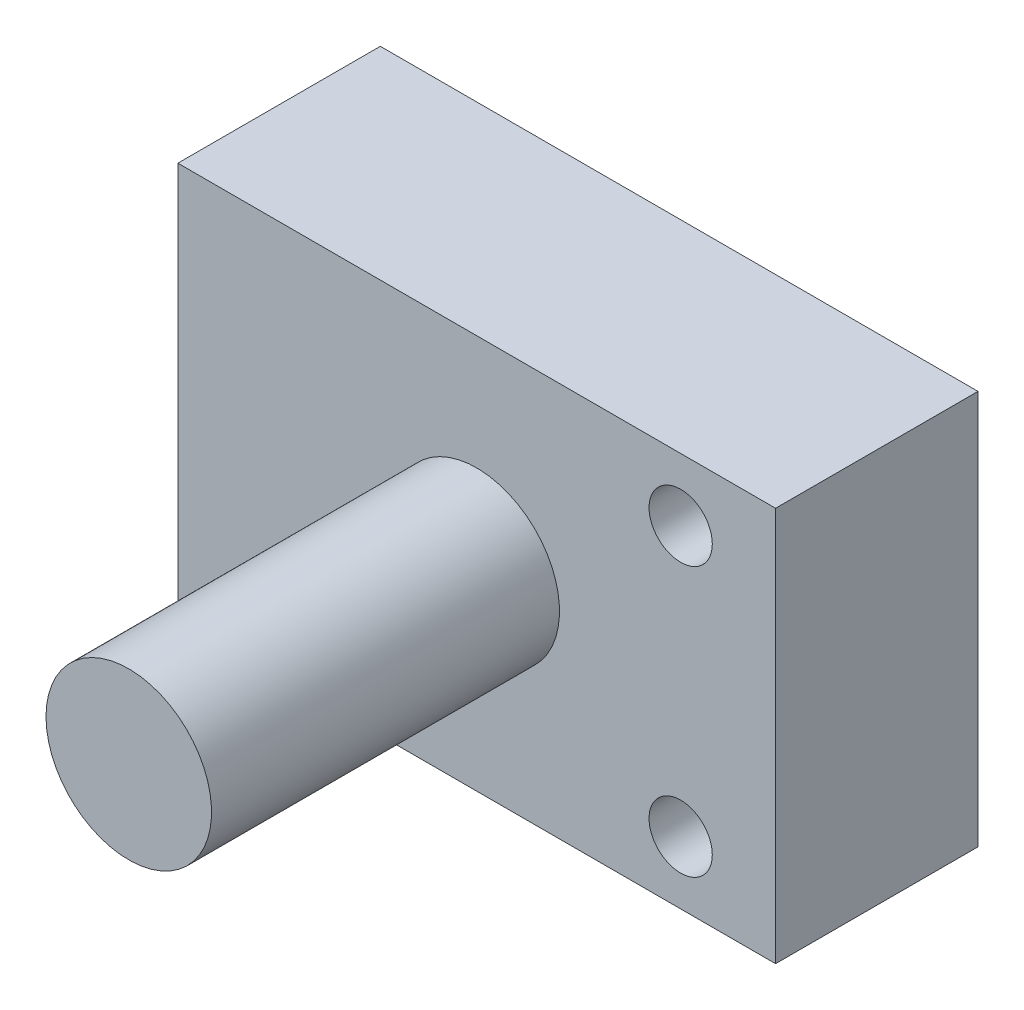
ISO-10303-21;
HEADER;
FILE_DESCRIPTION(('STEP AP214'),'2;1');
FILE_NAME('part.step','',(''),(''),'','','');
FILE_SCHEMA(('AUTOMOTIVE_DESIGN { 1 0 10303 214 1 1 1 1 }'));
ENDSEC;
DATA;
#1=APPLICATION_CONTEXT('core data for automotive mechanical design processes');
#2=APPLICATION_PROTOCOL_DEFINITION('international standard','automotive_design',2000,#1);
#3=PRODUCT_CONTEXT('',#1,'mechanical');
#4=PRODUCT('Part','Part','',(#3));
#5=PRODUCT_RELATED_PRODUCT_CATEGORY('part','',(#4));
#6=PRODUCT_DEFINITION_FORMATION('','',#4);
#7=PRODUCT_DEFINITION_CONTEXT('part definition',#1,'design');
#8=PRODUCT_DEFINITION('design','',#6,#7);
#9=PRODUCT_DEFINITION_SHAPE('','',#8);
#10=(LENGTH_UNIT() NAMED_UNIT(*) SI_UNIT(.MILLI.,.METRE.));
#11=(NAMED_UNIT(*) PLANE_ANGLE_UNIT() SI_UNIT($,.RADIAN.));
#12=(NAMED_UNIT(*) SI_UNIT($,.STERADIAN.) SOLID_ANGLE_UNIT());
#13=UNCERTAINTY_MEASURE_WITH_UNIT(LENGTH_MEASURE(1.E-05),#10,'distance_accuracy_value','');
#14=(GEOMETRIC_REPRESENTATION_CONTEXT(3) GLOBAL_UNCERTAINTY_ASSIGNED_CONTEXT((#13)) GLOBAL_UNIT_ASSIGNED_CONTEXT((#10,
#11,#12)) REPRESENTATION_CONTEXT('',''));
#15=CARTESIAN_POINT('',(0.,0.,0.));
#16=DIRECTION('',(0.,0.,1.));
#17=DIRECTION('',(1.,0.,0.));
#18=AXIS2_PLACEMENT_3D('',#15,#16,#17);
#19=CARTESIAN_POINT('',(47.2395343595921,31.1753699375983,32.));
#20=DIRECTION('',(-1.,0.,0.));
#21=DIRECTION('',(0.,0.,1.));
#22=AXIS2_PLACEMENT_3D('',#19,#20,#21);
#23=PLANE('',#22);
#24=DIRECTION('',(0.,1.,0.));
#25=VECTOR('',#24,1.);
#26=CARTESIAN_POINT('',(47.2395343595921,31.1753699375983,0.));
#27=LINE('',#26,#25);
#28=CARTESIAN_POINT('',(47.2395343595921,-31.1753699375983,0.));
#29=VERTEX_POINT('',#28);
#30=CARTESIAN_POINT('',(47.2395343595921,31.1753699375983,0.));
#31=VERTEX_POINT('',#30);
#32=EDGE_CURVE('E100',#29,#31,#27,.T.);
#33=ORIENTED_EDGE('',*,*,#32,.T.);
#34=DIRECTION('',(0.,0.,-1.));
#35=VECTOR('',#34,1.);
#36=CARTESIAN_POINT('',(47.2395343595921,31.1753699375983,32.));
#37=LINE('',#36,#35);
#38=CARTESIAN_POINT('',(47.2395343595921,31.1753699375983,32.));
#39=VERTEX_POINT('',#38);
#40=EDGE_CURVE('E11',#39,#31,#37,.T.);
#41=ORIENTED_EDGE('',*,*,#40,.F.);
#42=DIRECTION('',(0.,1.,0.));
#43=VECTOR('',#42,1.);
#44=CARTESIAN_POINT('',(47.2395343595921,31.1753699375983,32.));
#45=LINE('',#44,#43);
#46=CARTESIAN_POINT('',(47.2395343595921,-31.1753699375983,32.));
#47=VERTEX_POINT('',#46);
#48=EDGE_CURVE('E88',#47,#39,#45,.T.);
#49=ORIENTED_EDGE('',*,*,#48,.F.);
#50=DIRECTION('',(0.,0.,-1.));
#51=VECTOR('',#50,1.);
#52=CARTESIAN_POINT('',(47.2395343595921,-31.1753699375983,32.));
#53=LINE('',#52,#51);
#54=EDGE_CURVE('E96',#47,#29,#53,.T.);
#55=ORIENTED_EDGE('',*,*,#54,.T.);
#56=EDGE_LOOP('',(#33,#41,#49,#55));
#57=FACE_BOUND('',#56,.T.);
#58=ADVANCED_FACE('F37',(#57),#23,.F.);
#59=CARTESIAN_POINT('',(-47.2395343595921,31.1753699375983,32.));
#60=DIRECTION('',(0.,-1.,0.));
#61=DIRECTION('',(0.,0.,-1.));
#62=AXIS2_PLACEMENT_3D('',#59,#60,#61);
#63=PLANE('',#62);
#64=DIRECTION('',(-1.,0.,0.));
#65=VECTOR('',#64,1.);
#66=CARTESIAN_POINT('',(-47.2395343595921,31.1753699375983,0.));
#67=LINE('',#66,#65);
#68=CARTESIAN_POINT('',(-47.2395343595921,31.1753699375983,0.));
#69=VERTEX_POINT('',#68);
#70=EDGE_CURVE('E92',#31,#69,#67,.T.);
#71=ORIENTED_EDGE('',*,*,#70,.T.);
#72=DIRECTION('',(0.,0.,-1.));
#73=VECTOR('',#72,1.);
#74=CARTESIAN_POINT('',(-47.2395343595921,31.1753699375983,32.));
#75=LINE('',#74,#73);
#76=CARTESIAN_POINT('',(-47.2395343595921,31.1753699375983,32.));
#77=VERTEX_POINT('',#76);
#78=EDGE_CURVE('E45',#77,#69,#75,.T.);
#79=ORIENTED_EDGE('',*,*,#78,.F.);
#80=DIRECTION('',(-1.,0.,0.));
#81=VECTOR('',#80,1.);
#82=CARTESIAN_POINT('',(-47.2395343595921,31.1753699375983,32.));
#83=LINE('',#82,#81);
#84=EDGE_CURVE('E83',#39,#77,#83,.T.);
#85=ORIENTED_EDGE('',*,*,#84,.F.);
#86=ORIENTED_EDGE('',*,*,#40,.T.);
#87=EDGE_LOOP('',(#71,#79,#85,#86));
#88=FACE_BOUND('',#87,.T.);
#89=ADVANCED_FACE('F91',(#88),#63,.F.);
#90=CARTESIAN_POINT('',(-47.2395343595921,31.1753699375983,32.));
#91=DIRECTION('',(1.,0.,0.));
#92=DIRECTION('',(0.,0.,-1.));
#93=AXIS2_PLACEMENT_3D('',#90,#91,#92);
#94=PLANE('',#93);
#95=DIRECTION('',(0.,-1.,0.));
#96=VECTOR('',#95,1.);
#97=CARTESIAN_POINT('',(-47.2395343595921,31.1753699375983,0.));
#98=LINE('',#97,#96);
#99=CARTESIAN_POINT('',(-47.2395343595921,-31.1753699375983,0.));
#100=VERTEX_POINT('',#99);
#101=EDGE_CURVE('E70',#69,#100,#98,.T.);
#102=ORIENTED_EDGE('',*,*,#101,.T.);
#103=DIRECTION('',(0.,0.,-1.));
#104=VECTOR('',#103,1.);
#105=CARTESIAN_POINT('',(-47.2395343595921,-31.1753699375983,32.));
#106=LINE('',#105,#104);
#107=CARTESIAN_POINT('',(-47.2395343595921,-31.1753699375983,32.));
#108=VERTEX_POINT('',#107);
#109=EDGE_CURVE('E93',#108,#100,#106,.T.);
#110=ORIENTED_EDGE('',*,*,#109,.F.);
#111=DIRECTION('',(0.,-1.,0.));
#112=VECTOR('',#111,1.);
#113=CARTESIAN_POINT('',(-47.2395343595921,31.1753699375983,32.));
#114=LINE('',#113,#112);
#115=EDGE_CURVE('E86',#77,#108,#114,.T.);
#116=ORIENTED_EDGE('',*,*,#115,.F.);
#117=ORIENTED_EDGE('',*,*,#78,.T.);
#118=EDGE_LOOP('',(#102,#110,#116,#117));
#119=FACE_BOUND('',#118,.T.);
#120=ADVANCED_FACE('F94',(#119),#94,.F.);
#121=CARTESIAN_POINT('',(-47.2395343595921,-31.1753699375983,32.));
#122=DIRECTION('',(0.,1.,0.));
#123=DIRECTION('',(0.,0.,1.));
#124=AXIS2_PLACEMENT_3D('',#121,#122,#123);
#125=PLANE('',#124);
#126=DIRECTION('',(1.,0.,0.));
#127=VECTOR('',#126,1.);
#128=CARTESIAN_POINT('',(-47.2395343595921,-31.1753699375983,0.));
#129=LINE('',#128,#127);
#130=EDGE_CURVE('E76',#100,#29,#129,.T.);
#131=ORIENTED_EDGE('',*,*,#130,.T.);
#132=ORIENTED_EDGE('',*,*,#54,.F.);
#133=DIRECTION('',(1.,0.,0.));
#134=VECTOR('',#133,1.);
#135=CARTESIAN_POINT('',(-47.2395343595921,-31.1753699375983,32.));
#136=LINE('',#135,#134);
#137=EDGE_CURVE('E53',#108,#47,#136,.T.);
#138=ORIENTED_EDGE('',*,*,#137,.F.);
#139=ORIENTED_EDGE('',*,*,#109,.T.);
#140=EDGE_LOOP('',(#131,#132,#138,#139));
#141=FACE_BOUND('',#140,.T.);
#142=ADVANCED_FACE('F108',(#141),#125,.F.);
#143=CARTESIAN_POINT('',(0.,0.,32.));
#144=DIRECTION('',(0.,0.,1.));
#145=DIRECTION('',(1.,0.,0.));
#146=AXIS2_PLACEMENT_3D('',#143,#144,#145);
#147=PLANE('',#146);
#148=CARTESIAN_POINT('',(0.,0.,32.));
#149=DIRECTION('',(0.,0.,1.));
#150=DIRECTION('',(1.,0.,0.));
#151=AXIS2_PLACEMENT_3D('',#148,#149,#150);
#152=CIRCLE('',#151,13.0828545940413);
#153=CARTESIAN_POINT('',(-13.0828545940413,0.,32.));
#154=VERTEX_POINT('',#153);
#155=EDGE_CURVE('E126',#154,#154,#152,.T.);
#156=ORIENTED_EDGE('',*,*,#155,.F.);
#157=EDGE_LOOP('',(#156));
#158=FACE_BOUND('',#157,.T.);
#159=CARTESIAN_POINT('',(32.2395343595921,-21.2762344909124,32.));
#160=DIRECTION('',(0.,0.,1.));
#161=DIRECTION('',(1.,0.,0.));
#162=AXIS2_PLACEMENT_3D('',#159,#160,#161);
#163=CIRCLE('',#162,5.);
#164=CARTESIAN_POINT('',(37.2395343595921,-21.2762344909124,32.));
#165=VERTEX_POINT('',#164);
#166=EDGE_CURVE('E120',#165,#165,#163,.T.);
#167=ORIENTED_EDGE('',*,*,#166,.F.);
#168=EDGE_LOOP('',(#167));
#169=FACE_BOUND('',#168,.T.);
#170=CARTESIAN_POINT('',(32.2395343595921,21.2762344909124,32.));
#171=DIRECTION('',(0.,0.,1.));
#172=DIRECTION('',(1.,0.,0.));
#173=AXIS2_PLACEMENT_3D('',#170,#171,#172);
#174=CIRCLE('',#173,5.);
#175=CARTESIAN_POINT('',(37.2395343595921,21.2762344909124,32.));
#176=VERTEX_POINT('',#175);
#177=EDGE_CURVE('E114',#176,#176,#174,.T.);
#178=ORIENTED_EDGE('',*,*,#177,.F.);
#179=EDGE_LOOP('',(#178));
#180=FACE_BOUND('',#179,.T.);
#181=ORIENTED_EDGE('',*,*,#48,.T.);
#182=ORIENTED_EDGE('',*,*,#84,.T.);
#183=ORIENTED_EDGE('',*,*,#115,.T.);
#184=ORIENTED_EDGE('',*,*,#137,.T.);
#185=EDGE_LOOP('',(#181,#182,#183,#184));
#186=FACE_BOUND('',#185,.T.);
#187=ADVANCED_FACE('F84',(#158,#169,#180,#186),#147,.T.);
#188=CARTESIAN_POINT('',(0.,0.,0.));
#189=DIRECTION('',(0.,0.,1.));
#190=DIRECTION('',(1.,0.,0.));
#191=AXIS2_PLACEMENT_3D('',#188,#189,#190);
#192=PLANE('',#191);
#193=CARTESIAN_POINT('',(32.2395343595921,-21.2762344909124,0.));
#194=DIRECTION('',(0.,0.,1.));
#195=DIRECTION('',(1.,0.,0.));
#196=AXIS2_PLACEMENT_3D('',#193,#194,#195);
#197=CIRCLE('',#196,5.);
#198=CARTESIAN_POINT('',(37.2395343595921,-21.2762344909124,0.));
#199=VERTEX_POINT('',#198);
#200=EDGE_CURVE('E117',#199,#199,#197,.T.);
#201=ORIENTED_EDGE('',*,*,#200,.T.);
#202=EDGE_LOOP('',(#201));
#203=FACE_BOUND('',#202,.T.);
#204=CARTESIAN_POINT('',(32.2395343595921,21.2762344909124,0.));
#205=DIRECTION('',(0.,0.,1.));
#206=DIRECTION('',(1.,0.,0.));
#207=AXIS2_PLACEMENT_3D('',#204,#205,#206);
#208=CIRCLE('',#207,5.);
#209=CARTESIAN_POINT('',(37.2395343595921,21.2762344909124,0.));
#210=VERTEX_POINT('',#209);
#211=EDGE_CURVE('E103',#210,#210,#208,.T.);
#212=ORIENTED_EDGE('',*,*,#211,.T.);
#213=EDGE_LOOP('',(#212));
#214=FACE_BOUND('',#213,.T.);
#215=ORIENTED_EDGE('',*,*,#32,.F.);
#216=ORIENTED_EDGE('',*,*,#130,.F.);
#217=ORIENTED_EDGE('',*,*,#101,.F.);
#218=ORIENTED_EDGE('',*,*,#70,.F.);
#219=EDGE_LOOP('',(#215,#216,#217,#218));
#220=FACE_BOUND('',#219,.T.);
#221=ADVANCED_FACE('F111',(#203,#214,#220),#192,.F.);
#222=CARTESIAN_POINT('',(32.2395343595921,21.2762344909124,0.));
#223=DIRECTION('',(0.,0.,1.));
#224=DIRECTION('',(1.,0.,0.));
#225=AXIS2_PLACEMENT_3D('',#222,#223,#224);
#226=CYLINDRICAL_SURFACE('',#225,5.);
#227=ORIENTED_EDGE('',*,*,#211,.F.);
#228=EDGE_LOOP('',(#227));
#229=FACE_BOUND('',#228,.T.);
#230=ORIENTED_EDGE('',*,*,#177,.T.);
#231=EDGE_LOOP('',(#230));
#232=FACE_BOUND('',#231,.T.);
#233=ADVANCED_FACE('F148',(#229,#232),#226,.F.);
#234=CARTESIAN_POINT('',(32.2395343595921,-21.2762344909124,0.));
#235=DIRECTION('',(0.,0.,1.));
#236=DIRECTION('',(1.,0.,0.));
#237=AXIS2_PLACEMENT_3D('',#234,#235,#236);
#238=CYLINDRICAL_SURFACE('',#237,5.);
#239=ORIENTED_EDGE('',*,*,#200,.F.);
#240=EDGE_LOOP('',(#239));
#241=FACE_BOUND('',#240,.T.);
#242=ORIENTED_EDGE('',*,*,#166,.T.);
#243=EDGE_LOOP('',(#242));
#244=FACE_BOUND('',#243,.T.);
#245=ADVANCED_FACE('F137',(#241,#244),#238,.F.);
#246=CARTESIAN_POINT('',(0.,0.,87.));
#247=DIRECTION('',(0.,0.,-1.));
#248=DIRECTION('',(-1.,0.,0.));
#249=AXIS2_PLACEMENT_3D('',#246,#247,#248);
#250=CYLINDRICAL_SURFACE('',#249,13.0828545940413);
#251=CARTESIAN_POINT('',(0.,0.,87.));
#252=DIRECTION('',(0.,0.,1.));
#253=DIRECTION('',(1.,0.,0.));
#254=AXIS2_PLACEMENT_3D('',#251,#252,#253);
#255=CIRCLE('',#254,13.0828545940413);
#256=CARTESIAN_POINT('',(-13.0828545940413,0.,87.));
#257=VERTEX_POINT('',#256);
#258=EDGE_CURVE('E123',#257,#257,#255,.T.);
#259=CARTESIAN_POINT('',(-13.0828545940413,0.,87.));
#260=CARTESIAN_POINT('',(-13.0828545940413,0.,86.4270833333334));
#261=CARTESIAN_POINT('',(-13.0828545940413,0.,85.8541666666667));
#262=CARTESIAN_POINT('',(-13.0828545940413,0.,84.7083333333334));
#263=CARTESIAN_POINT('',(-13.0828545940413,0.,84.1354166666667));
#264=CARTESIAN_POINT('',(-13.0828545940413,0.,82.9895833333334));
#265=CARTESIAN_POINT('',(-13.0828545940413,0.,82.4166666666667));
#266=CARTESIAN_POINT('',(-13.0828545940413,0.,81.2708333333334));
#267=CARTESIAN_POINT('',(-13.0828545940413,0.,80.6979166666667));
#268=CARTESIAN_POINT('',(-13.0828545940413,0.,79.5520833333334));
#269=CARTESIAN_POINT('',(-13.0828545940413,0.,78.9791666666667));
#270=CARTESIAN_POINT('',(-13.0828545940413,0.,77.8333333333334));
#271=CARTESIAN_POINT('',(-13.0828545940413,0.,77.2604166666667));
#272=CARTESIAN_POINT('',(-13.0828545940413,0.,76.1145833333334));
#273=CARTESIAN_POINT('',(-13.0828545940413,0.,75.5416666666667));
#274=CARTESIAN_POINT('',(-13.0828545940413,0.,74.3958333333334));
#275=CARTESIAN_POINT('',(-13.0828545940413,0.,73.8229166666667));
#276=CARTESIAN_POINT('',(-13.0828545940413,0.,72.6770833333334));
#277=CARTESIAN_POINT('',(-13.0828545940413,0.,72.1041666666667));
#278=CARTESIAN_POINT('',(-13.0828545940413,0.,70.9583333333334));
#279=CARTESIAN_POINT('',(-13.0828545940413,0.,70.3854166666667));
#280=CARTESIAN_POINT('',(-13.0828545940413,0.,69.2395833333334));
#281=CARTESIAN_POINT('',(-13.0828545940413,0.,68.6666666666667));
#282=CARTESIAN_POINT('',(-13.0828545940413,0.,67.5208333333334));
#283=CARTESIAN_POINT('',(-13.0828545940413,0.,66.9479166666667));
#284=CARTESIAN_POINT('',(-13.0828545940413,0.,65.8020833333334));
#285=CARTESIAN_POINT('',(-13.0828545940413,0.,65.2291666666667));
#286=CARTESIAN_POINT('',(-13.0828545940413,0.,64.0833333333334));
#287=CARTESIAN_POINT('',(-13.0828545940413,0.,63.5104166666667));
#288=CARTESIAN_POINT('',(-13.0828545940413,0.,62.3645833333334));
#289=CARTESIAN_POINT('',(-13.0828545940413,0.,61.7916666666667));
#290=CARTESIAN_POINT('',(-13.0828545940413,0.,60.6458333333334));
#291=CARTESIAN_POINT('',(-13.0828545940413,0.,60.0729166666667));
#292=CARTESIAN_POINT('',(-13.0828545940413,0.,58.9270833333334));
#293=CARTESIAN_POINT('',(-13.0828545940413,0.,58.3541666666667));
#294=CARTESIAN_POINT('',(-13.0828545940413,0.,57.2083333333334));
#295=CARTESIAN_POINT('',(-13.0828545940413,0.,56.6354166666667));
#296=CARTESIAN_POINT('',(-13.0828545940413,0.,55.4895833333334));
#297=CARTESIAN_POINT('',(-13.0828545940413,0.,54.9166666666667));
#298=CARTESIAN_POINT('',(-13.0828545940413,0.,53.7708333333334));
#299=CARTESIAN_POINT('',(-13.0828545940413,0.,53.1979166666667));
#300=CARTESIAN_POINT('',(-13.0828545940413,0.,52.0520833333334));
#301=CARTESIAN_POINT('',(-13.0828545940413,0.,51.4791666666667));
#302=CARTESIAN_POINT('',(-13.0828545940413,0.,50.3333333333334));
#303=CARTESIAN_POINT('',(-13.0828545940413,0.,49.7604166666667));
#304=CARTESIAN_POINT('',(-13.0828545940413,0.,48.6145833333334));
#305=CARTESIAN_POINT('',(-13.0828545940413,0.,48.0416666666667));
#306=CARTESIAN_POINT('',(-13.0828545940413,0.,46.8958333333333));
#307=CARTESIAN_POINT('',(-13.0828545940413,0.,46.3229166666667));
#308=CARTESIAN_POINT('',(-13.0828545940413,0.,45.1770833333334));
#309=CARTESIAN_POINT('',(-13.0828545940413,0.,44.6041666666667));
#310=CARTESIAN_POINT('',(-13.0828545940413,0.,43.4583333333333));
#311=CARTESIAN_POINT('',(-13.0828545940413,0.,42.8854166666667));
#312=CARTESIAN_POINT('',(-13.0828545940413,0.,41.7395833333333));
#313=CARTESIAN_POINT('',(-13.0828545940413,0.,41.1666666666667));
#314=CARTESIAN_POINT('',(-13.0828545940413,0.,40.0208333333333));
#315=CARTESIAN_POINT('',(-13.0828545940413,0.,39.4479166666667));
#316=CARTESIAN_POINT('',(-13.0828545940413,0.,38.3020833333333));
#317=CARTESIAN_POINT('',(-13.0828545940413,0.,37.7291666666667));
#318=CARTESIAN_POINT('',(-13.0828545940413,0.,36.5833333333333));
#319=CARTESIAN_POINT('',(-13.0828545940413,0.,36.0104166666667));
#320=CARTESIAN_POINT('',(-13.0828545940413,0.,34.8645833333333));
#321=CARTESIAN_POINT('',(-13.0828545940413,0.,34.2916666666667));
#322=CARTESIAN_POINT('',(-13.0828545940413,0.,33.1458333333333));
#323=CARTESIAN_POINT('',(-13.0828545940413,0.,32.5729166666667));
#324=CARTESIAN_POINT('',(-13.0828545940413,0.,32.));
#325=B_SPLINE_CURVE_WITH_KNOTS('',3,(#259,#260,#261,#262,#263,#264,#265,#266,#267,#268,#269,
#270,#271,#272,#273,#274,#275,#276,#277,#278,#279,#280,#281,#282,#283,#284,#285,#286,#287,#288,
#289,#290,#291,#292,#293,#294,#295,#296,#297,#298,#299,#300,#301,#302,#303,#304,#305,#306,#307,
#308,#309,#310,#311,#312,#313,#314,#315,#316,#317,#318,#319,#320,#321,#322,#323,#324),
.UNSPECIFIED.,.F.,.F.,(4,2,2,2,2,2,2,2,2,2,2,2,2,2,2,2,2,2,2,2,2,2,2,2,2,2,2,2,2,2,2,2,4),(0.,
1.71874999999999,3.4375,5.15625,6.87499999999999,8.59375,10.3125,12.03125,13.75,15.46875,
17.1875,18.90625,20.625,22.34375,24.0625,25.78125,27.5,29.21875,30.9375,32.65625,34.375,
36.09375,37.8125,39.53125,41.25,42.96875,44.6875,46.40625,48.125,49.84375,51.5625,53.28125,55.),.UNSPECIFIED.);
#326=EDGE_CURVE('BSEAM134',#257,#154,#325,.T.);
#327=ORIENTED_EDGE('',*,*,#258,.F.);
#328=ORIENTED_EDGE('',*,*,#155,.T.);
#329=ORIENTED_EDGE('',*,*,#326,.T.);
#330=ORIENTED_EDGE('',*,*,#326,.F.);
#331=EDGE_LOOP('',(#327,#329,#328,#330));
#332=FACE_BOUND('',#331,.T.);
#333=ADVANCED_FACE('F134',(#332),#250,.T.);
#334=CARTESIAN_POINT('',(0.,0.,87.));
#335=DIRECTION('',(0.,0.,1.));
#336=DIRECTION('',(1.,0.,0.));
#337=AXIS2_PLACEMENT_3D('',#334,#335,#336);
#338=PLANE('',#337);
#339=ORIENTED_EDGE('',*,*,#258,.T.);
#340=EDGE_LOOP('',(#339));
#341=FACE_BOUND('',#340,.T.);
#342=ADVANCED_FACE('F132',(#341),#338,.T.);
#343=CLOSED_SHELL('',(#58,#89,#120,#142,#187,#221,#233,#245,#333,#342));
#344=MANIFOLD_SOLID_BREP('B2',#343);
#345=ADVANCED_BREP_SHAPE_REPRESENTATION('',(#18,#344),#14);
#346=SHAPE_DEFINITION_REPRESENTATION(#9,#345);
ENDSEC;
END-ISO-10303-21;
